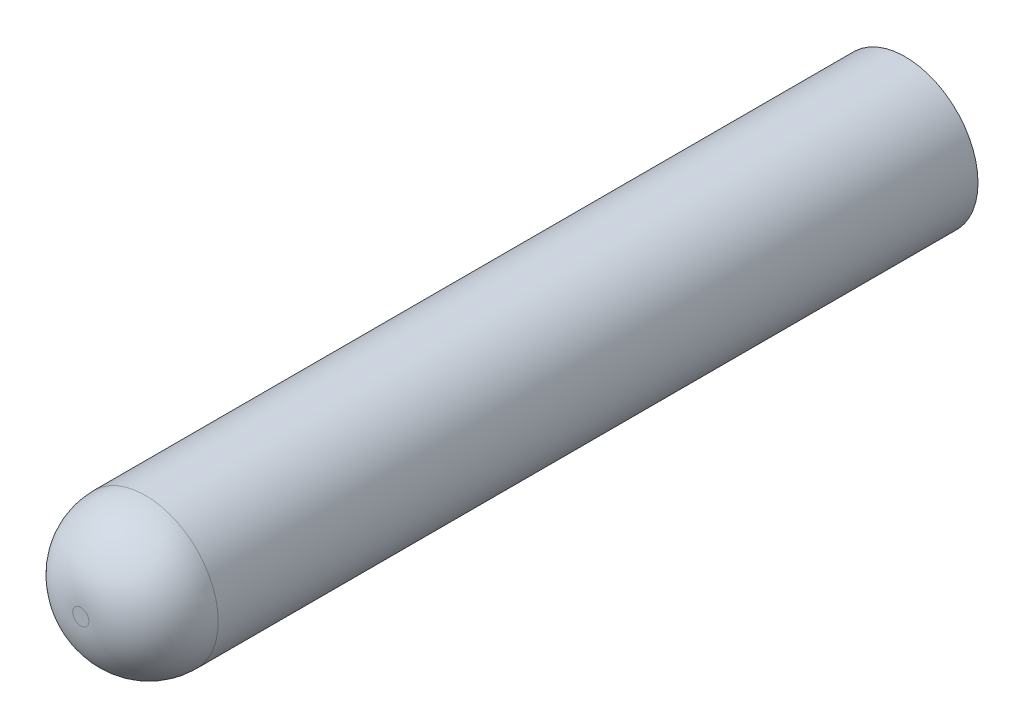
ISO-10303-21;
HEADER;
FILE_DESCRIPTION(('STEP AP214'),'2;1');
FILE_NAME('part.step','',(''),(''),'','','');
FILE_SCHEMA(('AUTOMOTIVE_DESIGN { 1 0 10303 214 1 1 1 1 }'));
ENDSEC;
DATA;
#1=APPLICATION_CONTEXT('core data for automotive mechanical design processes');
#2=APPLICATION_PROTOCOL_DEFINITION('international standard','automotive_design',2000,#1);
#3=PRODUCT_CONTEXT('',#1,'mechanical');
#4=PRODUCT('Part','Part','',(#3));
#5=PRODUCT_RELATED_PRODUCT_CATEGORY('part','',(#4));
#6=PRODUCT_DEFINITION_FORMATION('','',#4);
#7=PRODUCT_DEFINITION_CONTEXT('part definition',#1,'design');
#8=PRODUCT_DEFINITION('design','',#6,#7);
#9=PRODUCT_DEFINITION_SHAPE('','',#8);
#10=(LENGTH_UNIT() NAMED_UNIT(*) SI_UNIT(.MILLI.,.METRE.));
#11=(NAMED_UNIT(*) PLANE_ANGLE_UNIT() SI_UNIT($,.RADIAN.));
#12=(NAMED_UNIT(*) SI_UNIT($,.STERADIAN.) SOLID_ANGLE_UNIT());
#13=UNCERTAINTY_MEASURE_WITH_UNIT(LENGTH_MEASURE(1.E-05),#10,'distance_accuracy_value','');
#14=(GEOMETRIC_REPRESENTATION_CONTEXT(3) GLOBAL_UNCERTAINTY_ASSIGNED_CONTEXT((#13)) GLOBAL_UNIT_ASSIGNED_CONTEXT((#10,
#11,#12)) REPRESENTATION_CONTEXT('',''));
#15=CARTESIAN_POINT('',(0.,0.,0.));
#16=DIRECTION('',(0.,0.,1.));
#17=DIRECTION('',(1.,0.,0.));
#18=AXIS2_PLACEMENT_3D('',#15,#16,#17);
#19=CARTESIAN_POINT('',(0.,0.,25.5));
#20=DIRECTION('',(0.,0.,-1.));
#21=DIRECTION('',(-1.,0.,0.));
#22=AXIS2_PLACEMENT_3D('',#19,#20,#21);
#23=CYLINDRICAL_SURFACE('',#22,2.25);
#24=CARTESIAN_POINT('',(0.,0.,23.5));
#25=DIRECTION('',(0.,0.,1.));
#26=DIRECTION('',(1.,0.,0.));
#27=AXIS2_PLACEMENT_3D('',#24,#25,#26);
#28=CIRCLE('',#27,2.25);
#29=CARTESIAN_POINT('',(2.25,0.,23.5));
#30=VERTEX_POINT('',#29);
#31=EDGE_CURVE('E11',#30,#30,#28,.F.);
#32=ORIENTED_EDGE('',*,*,#31,.T.);
#33=EDGE_LOOP('',(#32));
#34=FACE_BOUND('',#33,.T.);
#35=CARTESIAN_POINT('',(0.,0.,0.));
#36=DIRECTION('',(0.,0.,1.));
#37=DIRECTION('',(1.,0.,0.));
#38=AXIS2_PLACEMENT_3D('',#35,#36,#37);
#39=CIRCLE('',#38,2.25);
#40=CARTESIAN_POINT('',(2.25,0.,0.));
#41=VERTEX_POINT('',#40);
#42=EDGE_CURVE('E126',#41,#41,#39,.T.);
#43=ORIENTED_EDGE('',*,*,#42,.T.);
#44=EDGE_LOOP('',(#43));
#45=FACE_BOUND('',#44,.T.);
#46=ADVANCED_FACE('F39',(#34,#45),#23,.T.);
#47=CARTESIAN_POINT('',(0.,0.,25.5));
#48=DIRECTION('',(0.,0.,1.));
#49=DIRECTION('',(1.,0.,0.));
#50=AXIS2_PLACEMENT_3D('',#47,#48,#49);
#51=PLANE('',#50);
#52=CARTESIAN_POINT('',(0.,0.,25.5));
#53=DIRECTION('',(0.,0.,1.));
#54=DIRECTION('',(1.,0.,0.));
#55=AXIS2_PLACEMENT_3D('',#52,#53,#54);
#56=CIRCLE('',#55,0.25);
#57=CARTESIAN_POINT('',(0.25,0.,25.5));
#58=VERTEX_POINT('',#57);
#59=EDGE_CURVE('E48',#58,#58,#56,.T.);
#60=ORIENTED_EDGE('',*,*,#59,.T.);
#61=EDGE_LOOP('',(#60));
#62=FACE_BOUND('',#61,.T.);
#63=ADVANCED_FACE('F137',(#62),#51,.T.);
#64=CARTESIAN_POINT('',(0.,0.,0.));
#65=DIRECTION('',(0.,0.,1.));
#66=DIRECTION('',(1.,0.,0.));
#67=AXIS2_PLACEMENT_3D('',#64,#65,#66);
#68=PLANE('',#67);
#69=DIRECTION('',(-1.,0.,0.));
#70=VECTOR('',#69,1.);
#71=CARTESIAN_POINT('',(0.,-1.2,0.));
#72=LINE('',#71,#70);
#73=CARTESIAN_POINT('',(1.2,-1.2,0.));
#74=VERTEX_POINT('',#73);
#75=CARTESIAN_POINT('',(-1.2,-1.2,0.));
#76=VERTEX_POINT('',#75);
#77=EDGE_CURVE('E90',#74,#76,#72,.T.);
#78=ORIENTED_EDGE('',*,*,#77,.F.);
#79=DIRECTION('',(0.,-1.,0.));
#80=VECTOR('',#79,1.);
#81=CARTESIAN_POINT('',(1.2,0.,0.));
#82=LINE('',#81,#80);
#83=CARTESIAN_POINT('',(1.2,1.2,0.));
#84=VERTEX_POINT('',#83);
#85=EDGE_CURVE('E55',#84,#74,#82,.T.);
#86=ORIENTED_EDGE('',*,*,#85,.F.);
#87=DIRECTION('',(1.,0.,0.));
#88=VECTOR('',#87,1.);
#89=CARTESIAN_POINT('',(0.,1.2,0.));
#90=LINE('',#89,#88);
#91=CARTESIAN_POINT('',(-1.2,1.2,0.));
#92=VERTEX_POINT('',#91);
#93=EDGE_CURVE('E110',#92,#84,#90,.T.);
#94=ORIENTED_EDGE('',*,*,#93,.F.);
#95=DIRECTION('',(0.,1.,0.));
#96=VECTOR('',#95,1.);
#97=CARTESIAN_POINT('',(-1.2,0.,0.));
#98=LINE('',#97,#96);
#99=EDGE_CURVE('E119',#76,#92,#98,.T.);
#100=ORIENTED_EDGE('',*,*,#99,.F.);
#101=EDGE_LOOP('',(#78,#86,#94,#100));
#102=FACE_BOUND('',#101,.T.);
#103=ORIENTED_EDGE('',*,*,#42,.F.);
#104=EDGE_LOOP('',(#103));
#105=FACE_BOUND('',#104,.T.);
#106=ADVANCED_FACE('F151',(#102,#105),#68,.F.);
#107=CARTESIAN_POINT('',(1.2,0.,4.5));
#108=DIRECTION('',(1.,0.,0.));
#109=DIRECTION('',(0.,0.,-1.));
#110=AXIS2_PLACEMENT_3D('',#107,#108,#109);
#111=PLANE('',#110);
#112=ORIENTED_EDGE('',*,*,#85,.T.);
#113=DIRECTION('',(0.,0.,-1.));
#114=VECTOR('',#113,1.);
#115=CARTESIAN_POINT('',(1.2,-1.2,4.5));
#116=LINE('',#115,#114);
#117=CARTESIAN_POINT('',(1.2,-1.2,4.5));
#118=VERTEX_POINT('',#117);
#119=EDGE_CURVE('E78',#118,#74,#116,.T.);
#120=ORIENTED_EDGE('',*,*,#119,.F.);
#121=DIRECTION('',(0.,-1.,0.));
#122=VECTOR('',#121,1.);
#123=CARTESIAN_POINT('',(1.2,0.,4.5));
#124=LINE('',#123,#122);
#125=CARTESIAN_POINT('',(1.2,1.2,4.5));
#126=VERTEX_POINT('',#125);
#127=EDGE_CURVE('E106',#126,#118,#124,.T.);
#128=ORIENTED_EDGE('',*,*,#127,.F.);
#129=DIRECTION('',(0.,0.,-1.));
#130=VECTOR('',#129,1.);
#131=CARTESIAN_POINT('',(1.2,1.2,4.5));
#132=LINE('',#131,#130);
#133=EDGE_CURVE('E63',#126,#84,#132,.T.);
#134=ORIENTED_EDGE('',*,*,#133,.T.);
#135=EDGE_LOOP('',(#112,#120,#128,#134));
#136=FACE_BOUND('',#135,.T.);
#137=ADVANCED_FACE('F156',(#136),#111,.F.);
#138=CARTESIAN_POINT('',(0.,1.2,4.5));
#139=DIRECTION('',(0.,1.,0.));
#140=DIRECTION('',(-1.,0.,0.));
#141=AXIS2_PLACEMENT_3D('',#138,#139,#140);
#142=PLANE('',#141);
#143=ORIENTED_EDGE('',*,*,#93,.T.);
#144=ORIENTED_EDGE('',*,*,#133,.F.);
#145=DIRECTION('',(1.,0.,0.));
#146=VECTOR('',#145,1.);
#147=CARTESIAN_POINT('',(0.,1.2,4.5));
#148=LINE('',#147,#146);
#149=CARTESIAN_POINT('',(-1.2,1.2,4.5));
#150=VERTEX_POINT('',#149);
#151=EDGE_CURVE('E103',#150,#126,#148,.T.);
#152=ORIENTED_EDGE('',*,*,#151,.F.);
#153=DIRECTION('',(0.,0.,-1.));
#154=VECTOR('',#153,1.);
#155=CARTESIAN_POINT('',(-1.2,1.2,4.5));
#156=LINE('',#155,#154);
#157=EDGE_CURVE('E95',#150,#92,#156,.T.);
#158=ORIENTED_EDGE('',*,*,#157,.T.);
#159=EDGE_LOOP('',(#143,#144,#152,#158));
#160=FACE_BOUND('',#159,.T.);
#161=ADVANCED_FACE('F161',(#160),#142,.F.);
#162=CARTESIAN_POINT('',(-1.2,0.,4.5));
#163=DIRECTION('',(-1.,0.,0.));
#164=DIRECTION('',(0.,0.,1.));
#165=AXIS2_PLACEMENT_3D('',#162,#163,#164);
#166=PLANE('',#165);
#167=ORIENTED_EDGE('',*,*,#99,.T.);
#168=ORIENTED_EDGE('',*,*,#157,.F.);
#169=DIRECTION('',(0.,1.,0.));
#170=VECTOR('',#169,1.);
#171=CARTESIAN_POINT('',(-1.2,0.,4.5));
#172=LINE('',#171,#170);
#173=CARTESIAN_POINT('',(-1.2,-1.2,4.5));
#174=VERTEX_POINT('',#173);
#175=EDGE_CURVE('E98',#174,#150,#172,.T.);
#176=ORIENTED_EDGE('',*,*,#175,.F.);
#177=DIRECTION('',(0.,0.,-1.));
#178=VECTOR('',#177,1.);
#179=CARTESIAN_POINT('',(-1.2,-1.2,4.5));
#180=LINE('',#179,#178);
#181=EDGE_CURVE('E83',#174,#76,#180,.T.);
#182=ORIENTED_EDGE('',*,*,#181,.T.);
#183=EDGE_LOOP('',(#167,#168,#176,#182));
#184=FACE_BOUND('',#183,.T.);
#185=ADVANCED_FACE('F99',(#184),#166,.F.);
#186=CARTESIAN_POINT('',(0.,-1.2,4.5));
#187=DIRECTION('',(0.,-1.,0.));
#188=DIRECTION('',(1.,0.,0.));
#189=AXIS2_PLACEMENT_3D('',#186,#187,#188);
#190=PLANE('',#189);
#191=ORIENTED_EDGE('',*,*,#77,.T.);
#192=ORIENTED_EDGE('',*,*,#181,.F.);
#193=DIRECTION('',(-1.,0.,0.));
#194=VECTOR('',#193,1.);
#195=CARTESIAN_POINT('',(0.,-1.2,4.5));
#196=LINE('',#195,#194);
#197=EDGE_CURVE('E87',#118,#174,#196,.T.);
#198=ORIENTED_EDGE('',*,*,#197,.F.);
#199=ORIENTED_EDGE('',*,*,#119,.T.);
#200=EDGE_LOOP('',(#191,#192,#198,#199));
#201=FACE_BOUND('',#200,.T.);
#202=ADVANCED_FACE('F85',(#201),#190,.F.);
#203=CARTESIAN_POINT('',(0.,0.,4.5));
#204=DIRECTION('',(0.,0.,-1.));
#205=DIRECTION('',(-1.,0.,0.));
#206=AXIS2_PLACEMENT_3D('',#203,#204,#205);
#207=PLANE('',#206);
#208=ORIENTED_EDGE('',*,*,#127,.T.);
#209=ORIENTED_EDGE('',*,*,#197,.T.);
#210=ORIENTED_EDGE('',*,*,#175,.T.);
#211=ORIENTED_EDGE('',*,*,#151,.T.);
#212=EDGE_LOOP('',(#208,#209,#210,#211));
#213=FACE_BOUND('',#212,.T.);
#214=ADVANCED_FACE('F105',(#213),#207,.T.);
#215=CARTESIAN_POINT('',(0.,0.,23.5));
#216=DIRECTION('',(0.,0.,1.));
#217=DIRECTION('',(1.,0.,0.));
#218=AXIS2_PLACEMENT_3D('',#215,#216,#217);
#219=DEGENERATE_TOROIDAL_SURFACE('',#218,0.25,2.,.T.);
#220=ORIENTED_EDGE('',*,*,#31,.F.);
#221=EDGE_LOOP('',(#220));
#222=FACE_BOUND('',#221,.T.);
#223=ORIENTED_EDGE('',*,*,#59,.F.);
#224=EDGE_LOOP('',(#223));
#225=FACE_BOUND('',#224,.T.);
#226=ADVANCED_FACE('F41',(#222,#225),#219,.T.);
#227=CLOSED_SHELL('',(#46,#63,#106,#137,#161,#185,#202,#214,#226));
#228=MANIFOLD_SOLID_BREP('B2',#227);
#229=ADVANCED_BREP_SHAPE_REPRESENTATION('',(#18,#228),#14);
#230=SHAPE_DEFINITION_REPRESENTATION(#9,#229);
ENDSEC;
END-ISO-10303-21;
